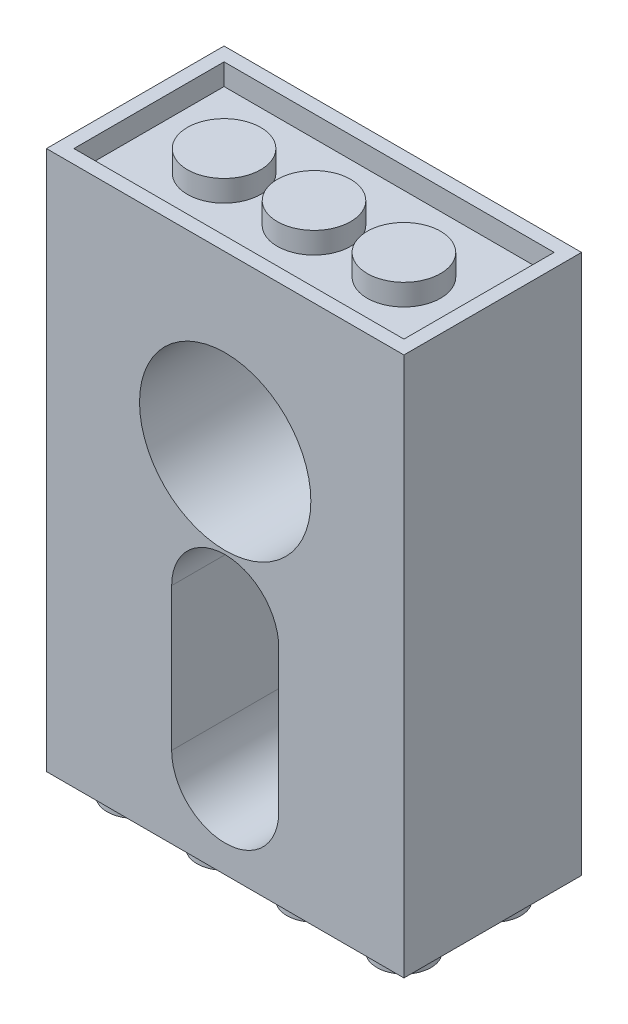
ISO-10303-21;
HEADER;
FILE_DESCRIPTION(('STEP AP214'),'2;1');
FILE_NAME('part.step','',(''),(''),'','','');
FILE_SCHEMA(('AUTOMOTIVE_DESIGN { 1 0 10303 214 1 1 1 1 }'));
ENDSEC;
DATA;
#1=APPLICATION_CONTEXT('core data for automotive mechanical design processes');
#2=APPLICATION_PROTOCOL_DEFINITION('international standard','automotive_design',2000,#1);
#3=PRODUCT_CONTEXT('',#1,'mechanical');
#4=PRODUCT('Part','Part','',(#3));
#5=PRODUCT_RELATED_PRODUCT_CATEGORY('part','',(#4));
#6=PRODUCT_DEFINITION_FORMATION('','',#4);
#7=PRODUCT_DEFINITION_CONTEXT('part definition',#1,'design');
#8=PRODUCT_DEFINITION('design','',#6,#7);
#9=PRODUCT_DEFINITION_SHAPE('','',#8);
#10=(LENGTH_UNIT() NAMED_UNIT(*) SI_UNIT(.MILLI.,.METRE.));
#11=(NAMED_UNIT(*) PLANE_ANGLE_UNIT() SI_UNIT($,.RADIAN.));
#12=(NAMED_UNIT(*) SI_UNIT($,.STERADIAN.) SOLID_ANGLE_UNIT());
#13=UNCERTAINTY_MEASURE_WITH_UNIT(LENGTH_MEASURE(1.E-05),#10,'distance_accuracy_value','');
#14=(GEOMETRIC_REPRESENTATION_CONTEXT(3) GLOBAL_UNCERTAINTY_ASSIGNED_CONTEXT((#13)) GLOBAL_UNIT_ASSIGNED_CONTEXT((#10,
#11,#12)) REPRESENTATION_CONTEXT('',''));
#15=CARTESIAN_POINT('',(0.,0.,0.));
#16=DIRECTION('',(0.,0.,1.));
#17=DIRECTION('',(1.,0.,0.));
#18=AXIS2_PLACEMENT_3D('',#15,#16,#17);
#19=CARTESIAN_POINT('',(-15.9,-24.,15.8));
#20=DIRECTION('',(0.,1.,0.));
#21=DIRECTION('',(0.,0.,1.));
#22=AXIS2_PLACEMENT_3D('',#19,#20,#21);
#23=PLANE('',#22);
#24=CARTESIAN_POINT('',(12.,-24.,11.9));
#25=DIRECTION('',(0.,1.,0.));
#26=DIRECTION('',(0.,0.,1.));
#27=AXIS2_PLACEMENT_3D('',#24,#25,#26);
#28=CIRCLE('',#27,2.4);
#29=CARTESIAN_POINT('',(12.,-24.,14.3));
#30=VERTEX_POINT('',#29);
#31=EDGE_CURVE('E41',#30,#30,#28,.F.);
#32=ORIENTED_EDGE('',*,*,#31,.F.);
#33=EDGE_LOOP('',(#32));
#34=FACE_BOUND('',#33,.T.);
#35=CARTESIAN_POINT('',(4.00000000000001,-24.,11.9));
#36=DIRECTION('',(0.,1.,0.));
#37=DIRECTION('',(0.,0.,1.));
#38=AXIS2_PLACEMENT_3D('',#35,#36,#37);
#39=CIRCLE('',#38,2.4);
#40=CARTESIAN_POINT('',(4.00000000000001,-24.,14.3));
#41=VERTEX_POINT('',#40);
#42=EDGE_CURVE('E340',#41,#41,#39,.F.);
#43=ORIENTED_EDGE('',*,*,#42,.F.);
#44=EDGE_LOOP('',(#43));
#45=FACE_BOUND('',#44,.T.);
#46=CARTESIAN_POINT('',(-3.99999999999999,-24.,11.9));
#47=DIRECTION('',(0.,1.,0.));
#48=DIRECTION('',(0.,0.,1.));
#49=AXIS2_PLACEMENT_3D('',#46,#47,#48);
#50=CIRCLE('',#49,2.4);
#51=CARTESIAN_POINT('',(-3.99999999999999,-24.,14.3));
#52=VERTEX_POINT('',#51);
#53=EDGE_CURVE('E334',#52,#52,#50,.F.);
#54=ORIENTED_EDGE('',*,*,#53,.F.);
#55=EDGE_LOOP('',(#54));
#56=FACE_BOUND('',#55,.T.);
#57=CARTESIAN_POINT('',(-12.,-24.,11.9));
#58=DIRECTION('',(0.,1.,0.));
#59=DIRECTION('',(0.,0.,1.));
#60=AXIS2_PLACEMENT_3D('',#57,#58,#59);
#61=CIRCLE('',#60,2.4);
#62=CARTESIAN_POINT('',(-12.,-24.,14.3));
#63=VERTEX_POINT('',#62);
#64=EDGE_CURVE('E320',#63,#63,#61,.F.);
#65=ORIENTED_EDGE('',*,*,#64,.F.);
#66=EDGE_LOOP('',(#65));
#67=FACE_BOUND('',#66,.T.);
#68=DIRECTION('',(1.,0.,0.));
#69=VECTOR('',#68,1.);
#70=CARTESIAN_POINT('',(-15.9,-24.,0.));
#71=LINE('',#70,#69);
#72=CARTESIAN_POINT('',(-15.9,-24.,0.));
#73=VERTEX_POINT('',#72);
#74=CARTESIAN_POINT('',(15.9,-24.,0.));
#75=VERTEX_POINT('',#74);
#76=EDGE_CURVE('E295',#73,#75,#71,.T.);
#77=ORIENTED_EDGE('',*,*,#76,.T.);
#78=DIRECTION('',(0.,0.,-1.));
#79=VECTOR('',#78,1.);
#80=CARTESIAN_POINT('',(15.9,-24.,15.8));
#81=LINE('',#80,#79);
#82=CARTESIAN_POINT('',(15.9,-24.,15.8));
#83=VERTEX_POINT('',#82);
#84=EDGE_CURVE('E301',#83,#75,#81,.T.);
#85=ORIENTED_EDGE('',*,*,#84,.F.);
#86=DIRECTION('',(1.,0.,0.));
#87=VECTOR('',#86,1.);
#88=CARTESIAN_POINT('',(-15.9,-24.,15.8));
#89=LINE('',#88,#87);
#90=CARTESIAN_POINT('',(-15.9,-24.,15.8));
#91=VERTEX_POINT('',#90);
#92=EDGE_CURVE('E299',#91,#83,#89,.T.);
#93=ORIENTED_EDGE('',*,*,#92,.F.);
#94=DIRECTION('',(0.,0.,-1.));
#95=VECTOR('',#94,1.);
#96=CARTESIAN_POINT('',(-15.9,-24.,15.8));
#97=LINE('',#96,#95);
#98=EDGE_CURVE('E311',#91,#73,#97,.T.);
#99=ORIENTED_EDGE('',*,*,#98,.T.);
#100=EDGE_LOOP('',(#77,#85,#93,#99));
#101=FACE_BOUND('',#100,.T.);
#102=CARTESIAN_POINT('',(-12.,-24.,3.9));
#103=DIRECTION('',(0.,1.,0.));
#104=DIRECTION('',(0.,0.,1.));
#105=AXIS2_PLACEMENT_3D('',#102,#103,#104);
#106=CIRCLE('',#105,2.4);
#107=CARTESIAN_POINT('',(-12.,-24.,6.3));
#108=VERTEX_POINT('',#107);
#109=EDGE_CURVE('E331',#108,#108,#106,.F.);
#110=ORIENTED_EDGE('',*,*,#109,.F.);
#111=EDGE_LOOP('',(#110));
#112=FACE_BOUND('',#111,.T.);
#113=CARTESIAN_POINT('',(-3.99999999999999,-24.,3.9));
#114=DIRECTION('',(0.,1.,0.));
#115=DIRECTION('',(0.,0.,1.));
#116=AXIS2_PLACEMENT_3D('',#113,#114,#115);
#117=CIRCLE('',#116,2.4);
#118=CARTESIAN_POINT('',(-3.99999999999999,-24.,6.3));
#119=VERTEX_POINT('',#118);
#120=EDGE_CURVE('E337',#119,#119,#117,.F.);
#121=ORIENTED_EDGE('',*,*,#120,.F.);
#122=EDGE_LOOP('',(#121));
#123=FACE_BOUND('',#122,.T.);
#124=CARTESIAN_POINT('',(4.00000000000001,-24.,3.9));
#125=DIRECTION('',(0.,1.,0.));
#126=DIRECTION('',(0.,0.,1.));
#127=AXIS2_PLACEMENT_3D('',#124,#125,#126);
#128=CIRCLE('',#127,2.4);
#129=CARTESIAN_POINT('',(4.00000000000001,-24.,6.3));
#130=VERTEX_POINT('',#129);
#131=EDGE_CURVE('E343',#130,#130,#128,.F.);
#132=ORIENTED_EDGE('',*,*,#131,.F.);
#133=EDGE_LOOP('',(#132));
#134=FACE_BOUND('',#133,.T.);
#135=CARTESIAN_POINT('',(12.,-24.,3.9));
#136=DIRECTION('',(0.,1.,0.));
#137=DIRECTION('',(0.,0.,1.));
#138=AXIS2_PLACEMENT_3D('',#135,#136,#137);
#139=CIRCLE('',#138,2.4);
#140=CARTESIAN_POINT('',(12.,-24.,6.3));
#141=VERTEX_POINT('',#140);
#142=EDGE_CURVE('E11',#141,#141,#139,.F.);
#143=ORIENTED_EDGE('',*,*,#142,.F.);
#144=EDGE_LOOP('',(#143));
#145=FACE_BOUND('',#144,.T.);
#146=ADVANCED_FACE('F33',(#34,#45,#56,#67,#101,#112,#123,#134,#145),#23,.F.);
#147=CARTESIAN_POINT('',(0.,-4.1,12.7));
#148=DIRECTION('',(0.,0.,-1.));
#149=DIRECTION('',(-1.,0.,0.));
#150=AXIS2_PLACEMENT_3D('',#147,#148,#149);
#151=CYLINDRICAL_SURFACE('',#150,1.8415);
#152=CARTESIAN_POINT('',(0.,-4.1,3.1));
#153=DIRECTION('',(0.,0.,1.));
#154=DIRECTION('',(1.,0.,0.));
#155=AXIS2_PLACEMENT_3D('',#152,#153,#154);
#156=CIRCLE('',#155,1.8415);
#157=CARTESIAN_POINT('',(1.8415,-4.1,3.1));
#158=VERTEX_POINT('',#157);
#159=EDGE_CURVE('E251',#158,#158,#156,.T.);
#160=ORIENTED_EDGE('',*,*,#159,.T.);
#161=EDGE_LOOP('',(#160));
#162=FACE_BOUND('',#161,.T.);
#163=CARTESIAN_POINT('',(0.,-4.1,1.905));
#164=DIRECTION('',(0.,0.,-1.));
#165=DIRECTION('',(-1.,0.,0.));
#166=AXIS2_PLACEMENT_3D('',#163,#164,#165);
#167=CIRCLE('',#166,1.8415);
#168=CARTESIAN_POINT('',(-1.8415,-4.1,1.905));
#169=VERTEX_POINT('',#168);
#170=EDGE_CURVE('E243',#169,#169,#167,.F.);
#171=ORIENTED_EDGE('',*,*,#170,.F.);
#172=EDGE_LOOP('',(#171));
#173=FACE_BOUND('',#172,.T.);
#174=ADVANCED_FACE('F352',(#162,#173),#151,.F.);
#175=CARTESIAN_POINT('',(0.,-16.8,12.7));
#176=DIRECTION('',(0.,0.,-1.));
#177=DIRECTION('',(-1.,0.,0.));
#178=AXIS2_PLACEMENT_3D('',#175,#176,#177);
#179=CYLINDRICAL_SURFACE('',#178,1.8415);
#180=CARTESIAN_POINT('',(0.,-16.8,3.1));
#181=DIRECTION('',(0.,0.,1.));
#182=DIRECTION('',(1.,0.,0.));
#183=AXIS2_PLACEMENT_3D('',#180,#181,#182);
#184=CIRCLE('',#183,1.8415);
#185=CARTESIAN_POINT('',(1.8415,-16.8,3.1));
#186=VERTEX_POINT('',#185);
#187=EDGE_CURVE('E246',#186,#186,#184,.T.);
#188=ORIENTED_EDGE('',*,*,#187,.T.);
#189=EDGE_LOOP('',(#188));
#190=FACE_BOUND('',#189,.T.);
#191=CARTESIAN_POINT('',(0.,-16.8,1.905));
#192=DIRECTION('',(0.,0.,-1.));
#193=DIRECTION('',(-1.,0.,0.));
#194=AXIS2_PLACEMENT_3D('',#191,#192,#193);
#195=CIRCLE('',#194,1.8415);
#196=CARTESIAN_POINT('',(-1.8415,-16.8,1.905));
#197=VERTEX_POINT('',#196);
#198=EDGE_CURVE('E237',#197,#197,#195,.F.);
#199=ORIENTED_EDGE('',*,*,#198,.F.);
#200=EDGE_LOOP('',(#199));
#201=FACE_BOUND('',#200,.T.);
#202=ADVANCED_FACE('F459',(#190,#201),#179,.F.);
#203=CARTESIAN_POINT('',(15.9,24.,15.8));
#204=DIRECTION('',(-1.,0.,0.));
#205=DIRECTION('',(0.,-1.,0.));
#206=AXIS2_PLACEMENT_3D('',#203,#204,#205);
#207=PLANE('',#206);
#208=DIRECTION('',(0.,1.,0.));
#209=VECTOR('',#208,1.);
#210=CARTESIAN_POINT('',(15.9,24.,0.));
#211=LINE('',#210,#209);
#212=CARTESIAN_POINT('',(15.9,24.,0.));
#213=VERTEX_POINT('',#212);
#214=EDGE_CURVE('E288',#75,#213,#211,.T.);
#215=ORIENTED_EDGE('',*,*,#214,.T.);
#216=DIRECTION('',(0.,0.,-1.));
#217=VECTOR('',#216,1.);
#218=CARTESIAN_POINT('',(15.9,24.,15.8));
#219=LINE('',#218,#217);
#220=CARTESIAN_POINT('',(15.9,24.,15.8));
#221=VERTEX_POINT('',#220);
#222=EDGE_CURVE('E317',#221,#213,#219,.T.);
#223=ORIENTED_EDGE('',*,*,#222,.F.);
#224=DIRECTION('',(0.,1.,0.));
#225=VECTOR('',#224,1.);
#226=CARTESIAN_POINT('',(15.9,24.,15.8));
#227=LINE('',#226,#225);
#228=EDGE_CURVE('E291',#83,#221,#227,.T.);
#229=ORIENTED_EDGE('',*,*,#228,.F.);
#230=ORIENTED_EDGE('',*,*,#84,.T.);
#231=EDGE_LOOP('',(#215,#223,#229,#230));
#232=FACE_BOUND('',#231,.T.);
#233=ADVANCED_FACE('F35',(#232),#207,.F.);
#234=CARTESIAN_POINT('',(-15.9,24.,15.8));
#235=DIRECTION('',(0.,-1.,0.));
#236=DIRECTION('',(0.,0.,-1.));
#237=AXIS2_PLACEMENT_3D('',#234,#235,#236);
#238=PLANE('',#237);
#239=DIRECTION('',(1.,0.,0.));
#240=VECTOR('',#239,1.);
#241=CARTESIAN_POINT('',(-14.68,24.,14.58));
#242=LINE('',#241,#240);
#243=CARTESIAN_POINT('',(-14.68,24.,14.58));
#244=VERTEX_POINT('',#243);
#245=CARTESIAN_POINT('',(14.68,24.,14.58));
#246=VERTEX_POINT('',#245);
#247=EDGE_CURVE('E178',#244,#246,#242,.T.);
#248=ORIENTED_EDGE('',*,*,#247,.F.);
#249=DIRECTION('',(0.,0.,1.));
#250=VECTOR('',#249,1.);
#251=CARTESIAN_POINT('',(-14.68,24.,14.58));
#252=LINE('',#251,#250);
#253=CARTESIAN_POINT('',(-14.68,24.,1.22));
#254=VERTEX_POINT('',#253);
#255=EDGE_CURVE('E48',#254,#244,#252,.T.);
#256=ORIENTED_EDGE('',*,*,#255,.F.);
#257=DIRECTION('',(-1.,0.,0.));
#258=VECTOR('',#257,1.);
#259=CARTESIAN_POINT('',(-14.68,24.,1.22));
#260=LINE('',#259,#258);
#261=CARTESIAN_POINT('',(14.68,24.,1.22));
#262=VERTEX_POINT('',#261);
#263=EDGE_CURVE('E166',#262,#254,#260,.T.);
#264=ORIENTED_EDGE('',*,*,#263,.F.);
#265=DIRECTION('',(0.,0.,-1.));
#266=VECTOR('',#265,1.);
#267=CARTESIAN_POINT('',(14.68,24.,14.58));
#268=LINE('',#267,#266);
#269=EDGE_CURVE('E169',#246,#262,#268,.T.);
#270=ORIENTED_EDGE('',*,*,#269,.F.);
#271=EDGE_LOOP('',(#248,#256,#264,#270));
#272=FACE_BOUND('',#271,.T.);
#273=DIRECTION('',(-1.,0.,0.));
#274=VECTOR('',#273,1.);
#275=CARTESIAN_POINT('',(-15.9,24.,0.));
#276=LINE('',#275,#274);
#277=CARTESIAN_POINT('',(-15.9,24.,0.));
#278=VERTEX_POINT('',#277);
#279=EDGE_CURVE('E304',#213,#278,#276,.T.);
#280=ORIENTED_EDGE('',*,*,#279,.T.);
#281=DIRECTION('',(0.,0.,-1.));
#282=VECTOR('',#281,1.);
#283=CARTESIAN_POINT('',(-15.9,24.,15.8));
#284=LINE('',#283,#282);
#285=CARTESIAN_POINT('',(-15.9,24.,15.8));
#286=VERTEX_POINT('',#285);
#287=EDGE_CURVE('E314',#286,#278,#284,.T.);
#288=ORIENTED_EDGE('',*,*,#287,.F.);
#289=DIRECTION('',(-1.,0.,0.));
#290=VECTOR('',#289,1.);
#291=CARTESIAN_POINT('',(-15.9,24.,15.8));
#292=LINE('',#291,#290);
#293=EDGE_CURVE('E294',#221,#286,#292,.T.);
#294=ORIENTED_EDGE('',*,*,#293,.F.);
#295=ORIENTED_EDGE('',*,*,#222,.T.);
#296=EDGE_LOOP('',(#280,#288,#294,#295));
#297=FACE_BOUND('',#296,.T.);
#298=ADVANCED_FACE('F507',(#272,#297),#238,.F.);
#299=CARTESIAN_POINT('',(-15.9,24.,15.8));
#300=DIRECTION('',(1.,0.,0.));
#301=DIRECTION('',(0.,1.,0.));
#302=AXIS2_PLACEMENT_3D('',#299,#300,#301);
#303=PLANE('',#302);
#304=DIRECTION('',(0.,-1.,0.));
#305=VECTOR('',#304,1.);
#306=CARTESIAN_POINT('',(-15.9,24.,0.));
#307=LINE('',#306,#305);
#308=EDGE_CURVE('E306',#278,#73,#307,.T.);
#309=ORIENTED_EDGE('',*,*,#308,.T.);
#310=ORIENTED_EDGE('',*,*,#98,.F.);
#311=DIRECTION('',(0.,-1.,0.));
#312=VECTOR('',#311,1.);
#313=CARTESIAN_POINT('',(-15.9,24.,15.8));
#314=LINE('',#313,#312);
#315=EDGE_CURVE('E297',#286,#91,#314,.T.);
#316=ORIENTED_EDGE('',*,*,#315,.F.);
#317=ORIENTED_EDGE('',*,*,#287,.T.);
#318=EDGE_LOOP('',(#309,#310,#316,#317));
#319=FACE_BOUND('',#318,.T.);
#320=ADVANCED_FACE('F501',(#319),#303,.F.);
#321=CARTESIAN_POINT('',(15.9,-24.,15.8));
#322=DIRECTION('',(0.,0.,1.));
#323=DIRECTION('',(1.,0.,0.));
#324=AXIS2_PLACEMENT_3D('',#321,#322,#323);
#325=PLANE('',#324);
#326=CARTESIAN_POINT('',(0.,-4.1,15.8));
#327=DIRECTION('',(0.,0.,1.));
#328=DIRECTION('',(1.,0.,0.));
#329=AXIS2_PLACEMENT_3D('',#326,#327,#328);
#330=CIRCLE('',#329,4.7625);
#331=CARTESIAN_POINT('',(4.76250000000001,-4.1,15.8));
#332=VERTEX_POINT('',#331);
#333=CARTESIAN_POINT('',(-4.76249999999999,-4.1,15.8));
#334=VERTEX_POINT('',#333);
#335=EDGE_CURVE('E266',#332,#334,#330,.T.);
#336=ORIENTED_EDGE('',*,*,#335,.F.);
#337=DIRECTION('',(0.,1.,0.));
#338=VECTOR('',#337,1.);
#339=CARTESIAN_POINT('',(4.76250000000001,-4.1,15.8));
#340=LINE('',#339,#338);
#341=CARTESIAN_POINT('',(4.76250000000001,-16.8,15.8));
#342=VERTEX_POINT('',#341);
#343=EDGE_CURVE('E256',#342,#332,#340,.T.);
#344=ORIENTED_EDGE('',*,*,#343,.F.);
#345=CARTESIAN_POINT('',(0.,-16.8,15.8));
#346=DIRECTION('',(0.,0.,1.));
#347=DIRECTION('',(1.,0.,0.));
#348=AXIS2_PLACEMENT_3D('',#345,#346,#347);
#349=CIRCLE('',#348,4.7625);
#350=CARTESIAN_POINT('',(-4.76249999999999,-16.8,15.8));
#351=VERTEX_POINT('',#350);
#352=EDGE_CURVE('E271',#351,#342,#349,.T.);
#353=ORIENTED_EDGE('',*,*,#352,.F.);
#354=DIRECTION('',(0.,-1.,0.));
#355=VECTOR('',#354,1.);
#356=CARTESIAN_POINT('',(-4.76249999999999,-4.1,15.8));
#357=LINE('',#356,#355);
#358=EDGE_CURVE('E268',#334,#351,#357,.T.);
#359=ORIENTED_EDGE('',*,*,#358,.F.);
#360=EDGE_LOOP('',(#336,#344,#353,#359));
#361=FACE_BOUND('',#360,.T.);
#362=CARTESIAN_POINT('',(0.,8.6,15.8));
#363=DIRECTION('',(0.,0.,1.));
#364=DIRECTION('',(1.,0.,0.));
#365=AXIS2_PLACEMENT_3D('',#362,#363,#364);
#366=CIRCLE('',#365,7.62);
#367=CARTESIAN_POINT('',(7.62000000000001,8.6,15.8));
#368=VERTEX_POINT('',#367);
#369=EDGE_CURVE('E278',#368,#368,#366,.T.);
#370=ORIENTED_EDGE('',*,*,#369,.F.);
#371=EDGE_LOOP('',(#370));
#372=FACE_BOUND('',#371,.T.);
#373=ORIENTED_EDGE('',*,*,#228,.T.);
#374=ORIENTED_EDGE('',*,*,#293,.T.);
#375=ORIENTED_EDGE('',*,*,#315,.T.);
#376=ORIENTED_EDGE('',*,*,#92,.T.);
#377=EDGE_LOOP('',(#373,#374,#375,#376));
#378=FACE_BOUND('',#377,.T.);
#379=ADVANCED_FACE('F498',(#361,#372,#378),#325,.T.);
#380=CARTESIAN_POINT('',(15.9,-24.,0.));
#381=DIRECTION('',(0.,0.,1.));
#382=DIRECTION('',(1.,0.,0.));
#383=AXIS2_PLACEMENT_3D('',#380,#381,#382);
#384=PLANE('',#383);
#385=DIRECTION('',(0.,-1.,0.));
#386=VECTOR('',#385,1.);
#387=CARTESIAN_POINT('',(4.76250000000001,-4.1,0.));
#388=LINE('',#387,#386);
#389=CARTESIAN_POINT('',(4.76250000000001,-4.1,0.));
#390=VERTEX_POINT('',#389);
#391=CARTESIAN_POINT('',(4.76250000000001,-16.8,0.));
#392=VERTEX_POINT('',#391);
#393=EDGE_CURVE('E227',#390,#392,#388,.T.);
#394=ORIENTED_EDGE('',*,*,#393,.F.);
#395=CARTESIAN_POINT('',(0.,-4.1,0.));
#396=DIRECTION('',(0.,0.,-1.));
#397=DIRECTION('',(-1.,0.,0.));
#398=AXIS2_PLACEMENT_3D('',#395,#396,#397);
#399=CIRCLE('',#398,4.7625);
#400=CARTESIAN_POINT('',(-4.76249999999999,-4.1,0.));
#401=VERTEX_POINT('',#400);
#402=EDGE_CURVE('E56',#401,#390,#399,.T.);
#403=ORIENTED_EDGE('',*,*,#402,.F.);
#404=DIRECTION('',(0.,1.,0.));
#405=VECTOR('',#404,1.);
#406=CARTESIAN_POINT('',(-4.76249999999999,-16.8,0.));
#407=LINE('',#406,#405);
#408=CARTESIAN_POINT('',(-4.76249999999999,-16.8,0.));
#409=VERTEX_POINT('',#408);
#410=EDGE_CURVE('E216',#409,#401,#407,.T.);
#411=ORIENTED_EDGE('',*,*,#410,.F.);
#412=CARTESIAN_POINT('',(0.,-16.8,0.));
#413=DIRECTION('',(0.,0.,-1.));
#414=DIRECTION('',(-1.,0.,0.));
#415=AXIS2_PLACEMENT_3D('',#412,#413,#414);
#416=CIRCLE('',#415,4.7625);
#417=EDGE_CURVE('E230',#392,#409,#416,.T.);
#418=ORIENTED_EDGE('',*,*,#417,.F.);
#419=EDGE_LOOP('',(#394,#403,#411,#418));
#420=FACE_BOUND('',#419,.T.);
#421=CARTESIAN_POINT('',(0.,8.6,0.));
#422=DIRECTION('',(0.,0.,-1.));
#423=DIRECTION('',(-1.,0.,0.));
#424=AXIS2_PLACEMENT_3D('',#421,#422,#423);
#425=CIRCLE('',#424,2.77815);
#426=CARTESIAN_POINT('',(-2.77815,8.6,0.));
#427=VERTEX_POINT('',#426);
#428=EDGE_CURVE('E247',#427,#427,#425,.T.);
#429=ORIENTED_EDGE('',*,*,#428,.F.);
#430=EDGE_LOOP('',(#429));
#431=FACE_BOUND('',#430,.T.);
#432=ORIENTED_EDGE('',*,*,#214,.F.);
#433=ORIENTED_EDGE('',*,*,#76,.F.);
#434=ORIENTED_EDGE('',*,*,#308,.F.);
#435=ORIENTED_EDGE('',*,*,#279,.F.);
#436=EDGE_LOOP('',(#432,#433,#434,#435));
#437=FACE_BOUND('',#436,.T.);
#438=ADVANCED_FACE('F496',(#420,#431,#437),#384,.F.);
#439=CARTESIAN_POINT('',(0.,8.6,3.1));
#440=DIRECTION('',(0.,0.,1.));
#441=DIRECTION('',(1.,0.,0.));
#442=AXIS2_PLACEMENT_3D('',#439,#440,#441);
#443=CYLINDRICAL_SURFACE('',#442,7.62);
#444=CARTESIAN_POINT('',(0.,8.6,3.1));
#445=DIRECTION('',(0.,0.,1.));
#446=DIRECTION('',(1.,0.,0.));
#447=AXIS2_PLACEMENT_3D('',#444,#445,#446);
#448=CIRCLE('',#447,7.62);
#449=CARTESIAN_POINT('',(7.62000000000001,8.6,3.1));
#450=VERTEX_POINT('',#449);
#451=EDGE_CURVE('E285',#450,#450,#448,.T.);
#452=ORIENTED_EDGE('',*,*,#451,.F.);
#453=EDGE_LOOP('',(#452));
#454=FACE_BOUND('',#453,.T.);
#455=ORIENTED_EDGE('',*,*,#369,.T.);
#456=EDGE_LOOP('',(#455));
#457=FACE_BOUND('',#456,.T.);
#458=ADVANCED_FACE('F492',(#454,#457),#443,.F.);
#459=CARTESIAN_POINT('',(0.,8.6,3.1));
#460=DIRECTION('',(0.,0.,1.));
#461=DIRECTION('',(1.,0.,0.));
#462=AXIS2_PLACEMENT_3D('',#459,#460,#461);
#463=PLANE('',#462);
#464=CARTESIAN_POINT('',(0.,8.6,3.1));
#465=DIRECTION('',(0.,0.,1.));
#466=DIRECTION('',(1.,0.,0.));
#467=AXIS2_PLACEMENT_3D('',#464,#465,#466);
#468=CIRCLE('',#467,2.77815);
#469=CARTESIAN_POINT('',(2.77815,8.6,3.1));
#470=VERTEX_POINT('',#469);
#471=EDGE_CURVE('E250',#470,#470,#468,.T.);
#472=ORIENTED_EDGE('',*,*,#471,.F.);
#473=EDGE_LOOP('',(#472));
#474=FACE_BOUND('',#473,.T.);
#475=ORIENTED_EDGE('',*,*,#451,.T.);
#476=EDGE_LOOP('',(#475));
#477=FACE_BOUND('',#476,.T.);
#478=ADVANCED_FACE('F488',(#474,#477),#463,.T.);
#479=CARTESIAN_POINT('',(0.,-4.1,3.1));
#480=DIRECTION('',(0.,0.,1.));
#481=DIRECTION('',(1.,0.,0.));
#482=AXIS2_PLACEMENT_3D('',#479,#480,#481);
#483=CYLINDRICAL_SURFACE('',#482,4.7625);
#484=ORIENTED_EDGE('',*,*,#335,.T.);
#485=DIRECTION('',(0.,0.,1.));
#486=VECTOR('',#485,1.);
#487=CARTESIAN_POINT('',(-4.76249999999999,-4.1,3.1));
#488=LINE('',#487,#486);
#489=CARTESIAN_POINT('',(-4.76249999999999,-4.1,3.1));
#490=VERTEX_POINT('',#489);
#491=EDGE_CURVE('E265',#490,#334,#488,.T.);
#492=ORIENTED_EDGE('',*,*,#491,.F.);
#493=CARTESIAN_POINT('',(0.,-4.1,3.1));
#494=DIRECTION('',(0.,0.,1.));
#495=DIRECTION('',(1.,0.,0.));
#496=AXIS2_PLACEMENT_3D('',#493,#494,#495);
#497=CIRCLE('',#496,4.7625);
#498=CARTESIAN_POINT('',(4.76250000000001,-4.1,3.1));
#499=VERTEX_POINT('',#498);
#500=EDGE_CURVE('E252',#499,#490,#497,.T.);
#501=ORIENTED_EDGE('',*,*,#500,.F.);
#502=DIRECTION('',(0.,0.,1.));
#503=VECTOR('',#502,1.);
#504=CARTESIAN_POINT('',(4.76250000000001,-4.1,3.1));
#505=LINE('',#504,#503);
#506=EDGE_CURVE('E276',#499,#332,#505,.T.);
#507=ORIENTED_EDGE('',*,*,#506,.T.);
#508=EDGE_LOOP('',(#484,#492,#501,#507));
#509=FACE_BOUND('',#508,.T.);
#510=ADVANCED_FACE('F478',(#509),#483,.F.);
#511=CARTESIAN_POINT('',(4.76250000000001,-4.1,3.1));
#512=DIRECTION('',(1.,0.,0.));
#513=DIRECTION('',(0.,1.,0.));
#514=AXIS2_PLACEMENT_3D('',#511,#512,#513);
#515=PLANE('',#514);
#516=ORIENTED_EDGE('',*,*,#343,.T.);
#517=ORIENTED_EDGE('',*,*,#506,.F.);
#518=DIRECTION('',(0.,1.,0.));
#519=VECTOR('',#518,1.);
#520=CARTESIAN_POINT('',(4.76250000000001,-4.1,3.1));
#521=LINE('',#520,#519);
#522=CARTESIAN_POINT('',(4.76250000000001,-16.8,3.1));
#523=VERTEX_POINT('',#522);
#524=EDGE_CURVE('E262',#523,#499,#521,.T.);
#525=ORIENTED_EDGE('',*,*,#524,.F.);
#526=DIRECTION('',(0.,0.,1.));
#527=VECTOR('',#526,1.);
#528=CARTESIAN_POINT('',(4.76250000000001,-16.8,3.1));
#529=LINE('',#528,#527);
#530=EDGE_CURVE('E279',#523,#342,#529,.T.);
#531=ORIENTED_EDGE('',*,*,#530,.T.);
#532=EDGE_LOOP('',(#516,#517,#525,#531));
#533=FACE_BOUND('',#532,.T.);
#534=ADVANCED_FACE('F474',(#533),#515,.F.);
#535=CARTESIAN_POINT('',(0.,-16.8,3.1));
#536=DIRECTION('',(0.,0.,1.));
#537=DIRECTION('',(1.,0.,0.));
#538=AXIS2_PLACEMENT_3D('',#535,#536,#537);
#539=CYLINDRICAL_SURFACE('',#538,4.7625);
#540=ORIENTED_EDGE('',*,*,#352,.T.);
#541=ORIENTED_EDGE('',*,*,#530,.F.);
#542=CARTESIAN_POINT('',(0.,-16.8,3.1));
#543=DIRECTION('',(0.,0.,1.));
#544=DIRECTION('',(1.,0.,0.));
#545=AXIS2_PLACEMENT_3D('',#542,#543,#544);
#546=CIRCLE('',#545,4.7625);
#547=CARTESIAN_POINT('',(-4.76249999999999,-16.8,3.1));
#548=VERTEX_POINT('',#547);
#549=EDGE_CURVE('E259',#548,#523,#546,.T.);
#550=ORIENTED_EDGE('',*,*,#549,.F.);
#551=DIRECTION('',(0.,0.,1.));
#552=VECTOR('',#551,1.);
#553=CARTESIAN_POINT('',(-4.76249999999999,-16.8,3.1));
#554=LINE('',#553,#552);
#555=EDGE_CURVE('E281',#548,#351,#554,.T.);
#556=ORIENTED_EDGE('',*,*,#555,.T.);
#557=EDGE_LOOP('',(#540,#541,#550,#556));
#558=FACE_BOUND('',#557,.T.);
#559=ADVANCED_FACE('F477',(#558),#539,.F.);
#560=CARTESIAN_POINT('',(-4.76249999999999,-4.1,3.1));
#561=DIRECTION('',(-1.,0.,0.));
#562=DIRECTION('',(0.,-1.,0.));
#563=AXIS2_PLACEMENT_3D('',#560,#561,#562);
#564=PLANE('',#563);
#565=ORIENTED_EDGE('',*,*,#358,.T.);
#566=ORIENTED_EDGE('',*,*,#555,.F.);
#567=DIRECTION('',(0.,-1.,0.));
#568=VECTOR('',#567,1.);
#569=CARTESIAN_POINT('',(-4.76249999999999,-4.1,3.1));
#570=LINE('',#569,#568);
#571=EDGE_CURVE('E255',#490,#548,#570,.T.);
#572=ORIENTED_EDGE('',*,*,#571,.F.);
#573=ORIENTED_EDGE('',*,*,#491,.T.);
#574=EDGE_LOOP('',(#565,#566,#572,#573));
#575=FACE_BOUND('',#574,.T.);
#576=ADVANCED_FACE('F472',(#575),#564,.F.);
#577=CARTESIAN_POINT('',(0.,-4.1,3.1));
#578=DIRECTION('',(0.,0.,1.));
#579=DIRECTION('',(1.,0.,0.));
#580=AXIS2_PLACEMENT_3D('',#577,#578,#579);
#581=PLANE('',#580);
#582=ORIENTED_EDGE('',*,*,#187,.F.);
#583=EDGE_LOOP('',(#582));
#584=FACE_BOUND('',#583,.T.);
#585=ORIENTED_EDGE('',*,*,#159,.F.);
#586=EDGE_LOOP('',(#585));
#587=FACE_BOUND('',#586,.T.);
#588=ORIENTED_EDGE('',*,*,#500,.T.);
#589=ORIENTED_EDGE('',*,*,#571,.T.);
#590=ORIENTED_EDGE('',*,*,#549,.T.);
#591=ORIENTED_EDGE('',*,*,#524,.T.);
#592=EDGE_LOOP('',(#588,#589,#590,#591));
#593=FACE_BOUND('',#592,.T.);
#594=ADVANCED_FACE('F468',(#584,#587,#593),#581,.T.);
#595=CARTESIAN_POINT('',(0.,8.6,12.7));
#596=DIRECTION('',(0.,0.,-1.));
#597=DIRECTION('',(-1.,0.,0.));
#598=AXIS2_PLACEMENT_3D('',#595,#596,#597);
#599=CYLINDRICAL_SURFACE('',#598,2.77815);
#600=ORIENTED_EDGE('',*,*,#471,.T.);
#601=EDGE_LOOP('',(#600));
#602=FACE_BOUND('',#601,.T.);
#603=ORIENTED_EDGE('',*,*,#428,.T.);
#604=EDGE_LOOP('',(#603));
#605=FACE_BOUND('',#604,.T.);
#606=ADVANCED_FACE('F444',(#602,#605),#599,.F.);
#607=CARTESIAN_POINT('',(0.,-4.1,1.905));
#608=DIRECTION('',(0.,0.,-1.));
#609=DIRECTION('',(-1.,0.,0.));
#610=AXIS2_PLACEMENT_3D('',#607,#608,#609);
#611=PLANE('',#610);
#612=ORIENTED_EDGE('',*,*,#198,.T.);
#613=EDGE_LOOP('',(#612));
#614=FACE_BOUND('',#613,.T.);
#615=CARTESIAN_POINT('',(0.,-4.1,1.905));
#616=DIRECTION('',(0.,0.,-1.));
#617=DIRECTION('',(-1.,0.,0.));
#618=AXIS2_PLACEMENT_3D('',#615,#616,#617);
#619=CIRCLE('',#618,4.7625);
#620=CARTESIAN_POINT('',(-4.76249999999999,-4.1,1.905));
#621=VERTEX_POINT('',#620);
#622=CARTESIAN_POINT('',(4.76250000000001,-4.1,1.905));
#623=VERTEX_POINT('',#622);
#624=EDGE_CURVE('E212',#621,#623,#619,.T.);
#625=ORIENTED_EDGE('',*,*,#624,.T.);
#626=DIRECTION('',(0.,-1.,0.));
#627=VECTOR('',#626,1.);
#628=CARTESIAN_POINT('',(4.76250000000001,-4.1,1.905));
#629=LINE('',#628,#627);
#630=CARTESIAN_POINT('',(4.76250000000001,-16.8,1.905));
#631=VERTEX_POINT('',#630);
#632=EDGE_CURVE('E215',#623,#631,#629,.T.);
#633=ORIENTED_EDGE('',*,*,#632,.T.);
#634=CARTESIAN_POINT('',(0.,-16.8,1.905));
#635=DIRECTION('',(0.,0.,-1.));
#636=DIRECTION('',(-1.,0.,0.));
#637=AXIS2_PLACEMENT_3D('',#634,#635,#636);
#638=CIRCLE('',#637,4.7625);
#639=CARTESIAN_POINT('',(-4.76249999999999,-16.8,1.905));
#640=VERTEX_POINT('',#639);
#641=EDGE_CURVE('E219',#631,#640,#638,.T.);
#642=ORIENTED_EDGE('',*,*,#641,.T.);
#643=DIRECTION('',(0.,1.,0.));
#644=VECTOR('',#643,1.);
#645=CARTESIAN_POINT('',(-4.76249999999999,-16.8,1.905));
#646=LINE('',#645,#644);
#647=EDGE_CURVE('E222',#640,#621,#646,.T.);
#648=ORIENTED_EDGE('',*,*,#647,.T.);
#649=EDGE_LOOP('',(#625,#633,#642,#648));
#650=FACE_BOUND('',#649,.T.);
#651=ORIENTED_EDGE('',*,*,#170,.T.);
#652=EDGE_LOOP('',(#651));
#653=FACE_BOUND('',#652,.T.);
#654=ADVANCED_FACE('F440',(#614,#650,#653),#611,.T.);
#655=CARTESIAN_POINT('',(0.,-4.1,1.905));
#656=DIRECTION('',(0.,0.,-1.));
#657=DIRECTION('',(-1.,0.,0.));
#658=AXIS2_PLACEMENT_3D('',#655,#656,#657);
#659=CYLINDRICAL_SURFACE('',#658,4.7625);
#660=ORIENTED_EDGE('',*,*,#402,.T.);
#661=DIRECTION('',(0.,0.,-1.));
#662=VECTOR('',#661,1.);
#663=CARTESIAN_POINT('',(4.76250000000001,-4.1,1.905));
#664=LINE('',#663,#662);
#665=EDGE_CURVE('E225',#623,#390,#664,.T.);
#666=ORIENTED_EDGE('',*,*,#665,.F.);
#667=ORIENTED_EDGE('',*,*,#624,.F.);
#668=DIRECTION('',(0.,0.,-1.));
#669=VECTOR('',#668,1.);
#670=CARTESIAN_POINT('',(-4.76249999999999,-4.1,1.905));
#671=LINE('',#670,#669);
#672=EDGE_CURVE('E235',#621,#401,#671,.T.);
#673=ORIENTED_EDGE('',*,*,#672,.T.);
#674=EDGE_LOOP('',(#660,#666,#667,#673));
#675=FACE_BOUND('',#674,.T.);
#676=ADVANCED_FACE('F443',(#675),#659,.F.);
#677=CARTESIAN_POINT('',(-4.76249999999999,-16.8,1.905));
#678=DIRECTION('',(-1.,0.,0.));
#679=DIRECTION('',(0.,-1.,0.));
#680=AXIS2_PLACEMENT_3D('',#677,#678,#679);
#681=PLANE('',#680);
#682=ORIENTED_EDGE('',*,*,#410,.T.);
#683=ORIENTED_EDGE('',*,*,#672,.F.);
#684=ORIENTED_EDGE('',*,*,#647,.F.);
#685=DIRECTION('',(0.,0.,-1.));
#686=VECTOR('',#685,1.);
#687=CARTESIAN_POINT('',(-4.76249999999999,-16.8,1.905));
#688=LINE('',#687,#686);
#689=EDGE_CURVE('E238',#640,#409,#688,.T.);
#690=ORIENTED_EDGE('',*,*,#689,.T.);
#691=EDGE_LOOP('',(#682,#683,#684,#690));
#692=FACE_BOUND('',#691,.T.);
#693=ADVANCED_FACE('F446',(#692),#681,.F.);
#694=CARTESIAN_POINT('',(0.,-16.8,1.905));
#695=DIRECTION('',(0.,0.,-1.));
#696=DIRECTION('',(-1.,0.,0.));
#697=AXIS2_PLACEMENT_3D('',#694,#695,#696);
#698=CYLINDRICAL_SURFACE('',#697,4.7625);
#699=ORIENTED_EDGE('',*,*,#417,.T.);
#700=ORIENTED_EDGE('',*,*,#689,.F.);
#701=ORIENTED_EDGE('',*,*,#641,.F.);
#702=DIRECTION('',(0.,0.,-1.));
#703=VECTOR('',#702,1.);
#704=CARTESIAN_POINT('',(4.76250000000001,-16.8,1.905));
#705=LINE('',#704,#703);
#706=EDGE_CURVE('E240',#631,#392,#705,.T.);
#707=ORIENTED_EDGE('',*,*,#706,.T.);
#708=EDGE_LOOP('',(#699,#700,#701,#707));
#709=FACE_BOUND('',#708,.T.);
#710=ADVANCED_FACE('F449',(#709),#698,.F.);
#711=CARTESIAN_POINT('',(4.76250000000001,-4.1,1.905));
#712=DIRECTION('',(1.,0.,0.));
#713=DIRECTION('',(0.,1.,0.));
#714=AXIS2_PLACEMENT_3D('',#711,#712,#713);
#715=PLANE('',#714);
#716=ORIENTED_EDGE('',*,*,#393,.T.);
#717=ORIENTED_EDGE('',*,*,#706,.F.);
#718=ORIENTED_EDGE('',*,*,#632,.F.);
#719=ORIENTED_EDGE('',*,*,#665,.T.);
#720=EDGE_LOOP('',(#716,#717,#718,#719));
#721=FACE_BOUND('',#720,.T.);
#722=ADVANCED_FACE('F438',(#721),#715,.F.);
#723=CARTESIAN_POINT('',(-12.,-25.905,11.9));
#724=DIRECTION('',(0.,1.,0.));
#725=DIRECTION('',(0.,0.,1.));
#726=AXIS2_PLACEMENT_3D('',#723,#724,#725);
#727=CYLINDRICAL_SURFACE('',#726,2.4);
#728=CARTESIAN_POINT('',(-12.,-25.905,11.9));
#729=DIRECTION('',(0.,-1.,0.));
#730=DIRECTION('',(0.,0.,-1.));
#731=AXIS2_PLACEMENT_3D('',#728,#729,#730);
#732=CIRCLE('',#731,2.4);
#733=CARTESIAN_POINT('',(-12.,-25.905,9.5));
#734=VERTEX_POINT('',#733);
#735=EDGE_CURVE('E209',#734,#734,#732,.T.);
#736=ORIENTED_EDGE('',*,*,#735,.F.);
#737=EDGE_LOOP('',(#736));
#738=FACE_BOUND('',#737,.T.);
#739=ORIENTED_EDGE('',*,*,#64,.T.);
#740=EDGE_LOOP('',(#739));
#741=FACE_BOUND('',#740,.T.);
#742=ADVANCED_FACE('F434',(#738,#741),#727,.T.);
#743=CARTESIAN_POINT('',(-12.,-25.905,11.9));
#744=DIRECTION('',(0.,-1.,0.));
#745=DIRECTION('',(0.,0.,-1.));
#746=AXIS2_PLACEMENT_3D('',#743,#744,#745);
#747=PLANE('',#746);
#748=ORIENTED_EDGE('',*,*,#735,.T.);
#749=EDGE_LOOP('',(#748));
#750=FACE_BOUND('',#749,.T.);
#751=ADVANCED_FACE('F430',(#750),#747,.T.);
#752=CARTESIAN_POINT('',(-12.,-25.905,3.9));
#753=DIRECTION('',(0.,1.,0.));
#754=DIRECTION('',(0.,0.,1.));
#755=AXIS2_PLACEMENT_3D('',#752,#753,#754);
#756=CYLINDRICAL_SURFACE('',#755,2.4);
#757=CARTESIAN_POINT('',(-12.,-25.905,3.9));
#758=DIRECTION('',(0.,-1.,0.));
#759=DIRECTION('',(0.,0.,-1.));
#760=AXIS2_PLACEMENT_3D('',#757,#758,#759);
#761=CIRCLE('',#760,2.4);
#762=CARTESIAN_POINT('',(-12.,-25.905,1.5));
#763=VERTEX_POINT('',#762);
#764=EDGE_CURVE('E206',#763,#763,#761,.T.);
#765=ORIENTED_EDGE('',*,*,#764,.F.);
#766=EDGE_LOOP('',(#765));
#767=FACE_BOUND('',#766,.T.);
#768=ORIENTED_EDGE('',*,*,#109,.T.);
#769=EDGE_LOOP('',(#768));
#770=FACE_BOUND('',#769,.T.);
#771=ADVANCED_FACE('F426',(#767,#770),#756,.T.);
#772=CARTESIAN_POINT('',(-12.,-25.905,3.9));
#773=DIRECTION('',(0.,-1.,0.));
#774=DIRECTION('',(0.,0.,-1.));
#775=AXIS2_PLACEMENT_3D('',#772,#773,#774);
#776=PLANE('',#775);
#777=ORIENTED_EDGE('',*,*,#764,.T.);
#778=EDGE_LOOP('',(#777));
#779=FACE_BOUND('',#778,.T.);
#780=ADVANCED_FACE('F422',(#779),#776,.T.);
#781=CARTESIAN_POINT('',(-3.99999999999999,-25.905,11.9));
#782=DIRECTION('',(0.,1.,0.));
#783=DIRECTION('',(0.,0.,1.));
#784=AXIS2_PLACEMENT_3D('',#781,#782,#783);
#785=CYLINDRICAL_SURFACE('',#784,2.4);
#786=CARTESIAN_POINT('',(-3.99999999999999,-25.905,11.9));
#787=DIRECTION('',(0.,-1.,0.));
#788=DIRECTION('',(0.,0.,-1.));
#789=AXIS2_PLACEMENT_3D('',#786,#787,#788);
#790=CIRCLE('',#789,2.4);
#791=CARTESIAN_POINT('',(-3.99999999999999,-25.905,9.5));
#792=VERTEX_POINT('',#791);
#793=EDGE_CURVE('E203',#792,#792,#790,.T.);
#794=ORIENTED_EDGE('',*,*,#793,.F.);
#795=EDGE_LOOP('',(#794));
#796=FACE_BOUND('',#795,.T.);
#797=ORIENTED_EDGE('',*,*,#53,.T.);
#798=EDGE_LOOP('',(#797));
#799=FACE_BOUND('',#798,.T.);
#800=ADVANCED_FACE('F418',(#796,#799),#785,.T.);
#801=CARTESIAN_POINT('',(-3.99999999999999,-25.905,11.9));
#802=DIRECTION('',(0.,-1.,0.));
#803=DIRECTION('',(0.,0.,-1.));
#804=AXIS2_PLACEMENT_3D('',#801,#802,#803);
#805=PLANE('',#804);
#806=ORIENTED_EDGE('',*,*,#793,.T.);
#807=EDGE_LOOP('',(#806));
#808=FACE_BOUND('',#807,.T.);
#809=ADVANCED_FACE('F414',(#808),#805,.T.);
#810=CARTESIAN_POINT('',(-3.99999999999999,-25.905,3.9));
#811=DIRECTION('',(0.,1.,0.));
#812=DIRECTION('',(0.,0.,1.));
#813=AXIS2_PLACEMENT_3D('',#810,#811,#812);
#814=CYLINDRICAL_SURFACE('',#813,2.4);
#815=CARTESIAN_POINT('',(-3.99999999999999,-25.905,3.9));
#816=DIRECTION('',(0.,-1.,0.));
#817=DIRECTION('',(0.,0.,-1.));
#818=AXIS2_PLACEMENT_3D('',#815,#816,#817);
#819=CIRCLE('',#818,2.4);
#820=CARTESIAN_POINT('',(-3.99999999999999,-25.905,1.5));
#821=VERTEX_POINT('',#820);
#822=EDGE_CURVE('E200',#821,#821,#819,.T.);
#823=ORIENTED_EDGE('',*,*,#822,.F.);
#824=EDGE_LOOP('',(#823));
#825=FACE_BOUND('',#824,.T.);
#826=ORIENTED_EDGE('',*,*,#120,.T.);
#827=EDGE_LOOP('',(#826));
#828=FACE_BOUND('',#827,.T.);
#829=ADVANCED_FACE('F410',(#825,#828),#814,.T.);
#830=CARTESIAN_POINT('',(-3.99999999999999,-25.905,3.9));
#831=DIRECTION('',(0.,-1.,0.));
#832=DIRECTION('',(0.,0.,-1.));
#833=AXIS2_PLACEMENT_3D('',#830,#831,#832);
#834=PLANE('',#833);
#835=ORIENTED_EDGE('',*,*,#822,.T.);
#836=EDGE_LOOP('',(#835));
#837=FACE_BOUND('',#836,.T.);
#838=ADVANCED_FACE('F406',(#837),#834,.T.);
#839=CARTESIAN_POINT('',(4.00000000000001,-25.905,11.9));
#840=DIRECTION('',(0.,1.,0.));
#841=DIRECTION('',(0.,0.,1.));
#842=AXIS2_PLACEMENT_3D('',#839,#840,#841);
#843=CYLINDRICAL_SURFACE('',#842,2.4);
#844=CARTESIAN_POINT('',(4.00000000000001,-25.905,11.9));
#845=DIRECTION('',(0.,-1.,0.));
#846=DIRECTION('',(0.,0.,-1.));
#847=AXIS2_PLACEMENT_3D('',#844,#845,#846);
#848=CIRCLE('',#847,2.4);
#849=CARTESIAN_POINT('',(4.00000000000001,-25.905,9.5));
#850=VERTEX_POINT('',#849);
#851=EDGE_CURVE('E197',#850,#850,#848,.T.);
#852=ORIENTED_EDGE('',*,*,#851,.F.);
#853=EDGE_LOOP('',(#852));
#854=FACE_BOUND('',#853,.T.);
#855=ORIENTED_EDGE('',*,*,#42,.T.);
#856=EDGE_LOOP('',(#855));
#857=FACE_BOUND('',#856,.T.);
#858=ADVANCED_FACE('F402',(#854,#857),#843,.T.);
#859=CARTESIAN_POINT('',(4.00000000000001,-25.905,11.9));
#860=DIRECTION('',(0.,-1.,0.));
#861=DIRECTION('',(0.,0.,-1.));
#862=AXIS2_PLACEMENT_3D('',#859,#860,#861);
#863=PLANE('',#862);
#864=ORIENTED_EDGE('',*,*,#851,.T.);
#865=EDGE_LOOP('',(#864));
#866=FACE_BOUND('',#865,.T.);
#867=ADVANCED_FACE('F398',(#866),#863,.T.);
#868=CARTESIAN_POINT('',(4.00000000000001,-25.905,3.9));
#869=DIRECTION('',(0.,1.,0.));
#870=DIRECTION('',(0.,0.,1.));
#871=AXIS2_PLACEMENT_3D('',#868,#869,#870);
#872=CYLINDRICAL_SURFACE('',#871,2.4);
#873=CARTESIAN_POINT('',(4.00000000000001,-25.905,3.9));
#874=DIRECTION('',(0.,-1.,0.));
#875=DIRECTION('',(0.,0.,-1.));
#876=AXIS2_PLACEMENT_3D('',#873,#874,#875);
#877=CIRCLE('',#876,2.4);
#878=CARTESIAN_POINT('',(4.00000000000001,-25.905,1.5));
#879=VERTEX_POINT('',#878);
#880=EDGE_CURVE('E194',#879,#879,#877,.T.);
#881=ORIENTED_EDGE('',*,*,#880,.F.);
#882=EDGE_LOOP('',(#881));
#883=FACE_BOUND('',#882,.T.);
#884=ORIENTED_EDGE('',*,*,#131,.T.);
#885=EDGE_LOOP('',(#884));
#886=FACE_BOUND('',#885,.T.);
#887=ADVANCED_FACE('F394',(#883,#886),#872,.T.);
#888=CARTESIAN_POINT('',(4.00000000000001,-25.905,3.9));
#889=DIRECTION('',(0.,-1.,0.));
#890=DIRECTION('',(0.,0.,-1.));
#891=AXIS2_PLACEMENT_3D('',#888,#889,#890);
#892=PLANE('',#891);
#893=ORIENTED_EDGE('',*,*,#880,.T.);
#894=EDGE_LOOP('',(#893));
#895=FACE_BOUND('',#894,.T.);
#896=ADVANCED_FACE('F390',(#895),#892,.T.);
#897=CARTESIAN_POINT('',(12.,-25.905,11.9));
#898=DIRECTION('',(0.,1.,0.));
#899=DIRECTION('',(0.,0.,1.));
#900=AXIS2_PLACEMENT_3D('',#897,#898,#899);
#901=CYLINDRICAL_SURFACE('',#900,2.4);
#902=CARTESIAN_POINT('',(12.,-25.905,11.9));
#903=DIRECTION('',(0.,-1.,0.));
#904=DIRECTION('',(0.,0.,-1.));
#905=AXIS2_PLACEMENT_3D('',#902,#903,#904);
#906=CIRCLE('',#905,2.4);
#907=CARTESIAN_POINT('',(12.,-25.905,9.5));
#908=VERTEX_POINT('',#907);
#909=EDGE_CURVE('E191',#908,#908,#906,.T.);
#910=ORIENTED_EDGE('',*,*,#909,.F.);
#911=EDGE_LOOP('',(#910));
#912=FACE_BOUND('',#911,.T.);
#913=ORIENTED_EDGE('',*,*,#31,.T.);
#914=EDGE_LOOP('',(#913));
#915=FACE_BOUND('',#914,.T.);
#916=ADVANCED_FACE('F348',(#912,#915),#901,.T.);
#917=CARTESIAN_POINT('',(12.,-25.905,11.9));
#918=DIRECTION('',(0.,-1.,0.));
#919=DIRECTION('',(0.,0.,-1.));
#920=AXIS2_PLACEMENT_3D('',#917,#918,#919);
#921=PLANE('',#920);
#922=ORIENTED_EDGE('',*,*,#909,.T.);
#923=EDGE_LOOP('',(#922));
#924=FACE_BOUND('',#923,.T.);
#925=ADVANCED_FACE('F374',(#924),#921,.T.);
#926=CARTESIAN_POINT('',(12.,-25.905,3.9));
#927=DIRECTION('',(0.,1.,0.));
#928=DIRECTION('',(0.,0.,1.));
#929=AXIS2_PLACEMENT_3D('',#926,#927,#928);
#930=CYLINDRICAL_SURFACE('',#929,2.4);
#931=CARTESIAN_POINT('',(12.,-25.905,3.9));
#932=DIRECTION('',(0.,-1.,0.));
#933=DIRECTION('',(0.,0.,-1.));
#934=AXIS2_PLACEMENT_3D('',#931,#932,#933);
#935=CIRCLE('',#934,2.4);
#936=CARTESIAN_POINT('',(12.,-25.905,1.5));
#937=VERTEX_POINT('',#936);
#938=EDGE_CURVE('E185',#937,#937,#935,.T.);
#939=ORIENTED_EDGE('',*,*,#938,.F.);
#940=EDGE_LOOP('',(#939));
#941=FACE_BOUND('',#940,.T.);
#942=ORIENTED_EDGE('',*,*,#142,.T.);
#943=EDGE_LOOP('',(#942));
#944=FACE_BOUND('',#943,.T.);
#945=ADVANCED_FACE('F371',(#941,#944),#930,.T.);
#946=CARTESIAN_POINT('',(12.,-25.905,3.9));
#947=DIRECTION('',(0.,-1.,0.));
#948=DIRECTION('',(0.,0.,-1.));
#949=AXIS2_PLACEMENT_3D('',#946,#947,#948);
#950=PLANE('',#949);
#951=ORIENTED_EDGE('',*,*,#938,.T.);
#952=EDGE_LOOP('',(#951));
#953=FACE_BOUND('',#952,.T.);
#954=ADVANCED_FACE('F373',(#953),#950,.T.);
#955=CARTESIAN_POINT('',(-14.68,22.095,14.58));
#956=DIRECTION('',(-1.,0.,0.));
#957=DIRECTION('',(0.,0.,1.));
#958=AXIS2_PLACEMENT_3D('',#955,#956,#957);
#959=PLANE('',#958);
#960=ORIENTED_EDGE('',*,*,#255,.T.);
#961=DIRECTION('',(0.,1.,0.));
#962=VECTOR('',#961,1.);
#963=CARTESIAN_POINT('',(-14.68,22.095,14.58));
#964=LINE('',#963,#962);
#965=CARTESIAN_POINT('',(-14.68,22.095,14.58));
#966=VERTEX_POINT('',#965);
#967=EDGE_CURVE('E144',#966,#244,#964,.T.);
#968=ORIENTED_EDGE('',*,*,#967,.F.);
#969=DIRECTION('',(0.,0.,1.));
#970=VECTOR('',#969,1.);
#971=CARTESIAN_POINT('',(-14.68,22.095,14.58));
#972=LINE('',#971,#970);
#973=CARTESIAN_POINT('',(-14.68,22.095,1.22));
#974=VERTEX_POINT('',#973);
#975=EDGE_CURVE('E148',#974,#966,#972,.T.);
#976=ORIENTED_EDGE('',*,*,#975,.F.);
#977=DIRECTION('',(0.,1.,0.));
#978=VECTOR('',#977,1.);
#979=CARTESIAN_POINT('',(-14.68,22.095,1.22));
#980=LINE('',#979,#978);
#981=EDGE_CURVE('E183',#974,#254,#980,.T.);
#982=ORIENTED_EDGE('',*,*,#981,.T.);
#983=EDGE_LOOP('',(#960,#968,#976,#982));
#984=FACE_BOUND('',#983,.T.);
#985=ADVANCED_FACE('F146',(#984),#959,.F.);
#986=CARTESIAN_POINT('',(-14.68,22.095,1.22));
#987=DIRECTION('',(0.,0.,-1.));
#988=DIRECTION('',(-1.,0.,0.));
#989=AXIS2_PLACEMENT_3D('',#986,#987,#988);
#990=PLANE('',#989);
#991=ORIENTED_EDGE('',*,*,#263,.T.);
#992=ORIENTED_EDGE('',*,*,#981,.F.);
#993=DIRECTION('',(-1.,0.,0.));
#994=VECTOR('',#993,1.);
#995=CARTESIAN_POINT('',(-14.68,22.095,1.22));
#996=LINE('',#995,#994);
#997=CARTESIAN_POINT('',(14.68,22.095,1.22));
#998=VERTEX_POINT('',#997);
#999=EDGE_CURVE('E154',#998,#974,#996,.T.);
#1000=ORIENTED_EDGE('',*,*,#999,.F.);
#1001=DIRECTION('',(0.,1.,0.));
#1002=VECTOR('',#1001,1.);
#1003=CARTESIAN_POINT('',(14.68,22.095,1.22));
#1004=LINE('',#1003,#1002);
#1005=EDGE_CURVE('E186',#998,#262,#1004,.T.);
#1006=ORIENTED_EDGE('',*,*,#1005,.T.);
#1007=EDGE_LOOP('',(#991,#992,#1000,#1006));
#1008=FACE_BOUND('',#1007,.T.);
#1009=ADVANCED_FACE('F569',(#1008),#990,.F.);
#1010=CARTESIAN_POINT('',(14.68,22.095,14.58));
#1011=DIRECTION('',(1.,0.,0.));
#1012=DIRECTION('',(0.,0.,-1.));
#1013=AXIS2_PLACEMENT_3D('',#1010,#1011,#1012);
#1014=PLANE('',#1013);
#1015=ORIENTED_EDGE('',*,*,#269,.T.);
#1016=ORIENTED_EDGE('',*,*,#1005,.F.);
#1017=DIRECTION('',(0.,0.,-1.));
#1018=VECTOR('',#1017,1.);
#1019=CARTESIAN_POINT('',(14.68,22.095,14.58));
#1020=LINE('',#1019,#1018);
#1021=CARTESIAN_POINT('',(14.68,22.095,14.58));
#1022=VERTEX_POINT('',#1021);
#1023=EDGE_CURVE('E162',#1022,#998,#1020,.T.);
#1024=ORIENTED_EDGE('',*,*,#1023,.F.);
#1025=DIRECTION('',(0.,1.,0.));
#1026=VECTOR('',#1025,1.);
#1027=CARTESIAN_POINT('',(14.68,22.095,14.58));
#1028=LINE('',#1027,#1026);
#1029=EDGE_CURVE('E153',#1022,#246,#1028,.T.);
#1030=ORIENTED_EDGE('',*,*,#1029,.T.);
#1031=EDGE_LOOP('',(#1015,#1016,#1024,#1030));
#1032=FACE_BOUND('',#1031,.T.);
#1033=ADVANCED_FACE('F572',(#1032),#1014,.F.);
#1034=CARTESIAN_POINT('',(-14.68,22.095,14.58));
#1035=DIRECTION('',(0.,0.,1.));
#1036=DIRECTION('',(1.,0.,0.));
#1037=AXIS2_PLACEMENT_3D('',#1034,#1035,#1036);
#1038=PLANE('',#1037);
#1039=ORIENTED_EDGE('',*,*,#247,.T.);
#1040=ORIENTED_EDGE('',*,*,#1029,.F.);
#1041=DIRECTION('',(1.,0.,0.));
#1042=VECTOR('',#1041,1.);
#1043=CARTESIAN_POINT('',(-14.68,22.095,14.58));
#1044=LINE('',#1043,#1042);
#1045=EDGE_CURVE('E157',#966,#1022,#1044,.T.);
#1046=ORIENTED_EDGE('',*,*,#1045,.F.);
#1047=ORIENTED_EDGE('',*,*,#967,.T.);
#1048=EDGE_LOOP('',(#1039,#1040,#1046,#1047));
#1049=FACE_BOUND('',#1048,.T.);
#1050=ADVANCED_FACE('F158',(#1049),#1038,.F.);
#1051=CARTESIAN_POINT('',(-14.68,22.095,1.22));
#1052=DIRECTION('',(0.,-1.,0.));
#1053=DIRECTION('',(0.,0.,-1.));
#1054=AXIS2_PLACEMENT_3D('',#1051,#1052,#1053);
#1055=PLANE('',#1054);
#1056=CARTESIAN_POINT('',(8.,22.095,7.9));
#1057=DIRECTION('',(0.,1.,0.));
#1058=DIRECTION('',(0.,0.,1.));
#1059=AXIS2_PLACEMENT_3D('',#1056,#1057,#1058);
#1060=CIRCLE('',#1059,3.2605);
#1061=CARTESIAN_POINT('',(8.,22.095,11.1605));
#1062=VERTEX_POINT('',#1061);
#1063=EDGE_CURVE('E543',#1062,#1062,#1060,.T.);
#1064=ORIENTED_EDGE('',*,*,#1063,.F.);
#1065=EDGE_LOOP('',(#1064));
#1066=FACE_BOUND('',#1065,.T.);
#1067=CARTESIAN_POINT('',(0.,22.095,7.9));
#1068=DIRECTION('',(0.,1.,0.));
#1069=DIRECTION('',(0.,0.,1.));
#1070=AXIS2_PLACEMENT_3D('',#1067,#1068,#1069);
#1071=CIRCLE('',#1070,3.2605);
#1072=CARTESIAN_POINT('',(0.,22.095,11.1605));
#1073=VERTEX_POINT('',#1072);
#1074=EDGE_CURVE('E542',#1073,#1073,#1071,.T.);
#1075=ORIENTED_EDGE('',*,*,#1074,.F.);
#1076=EDGE_LOOP('',(#1075));
#1077=FACE_BOUND('',#1076,.T.);
#1078=CARTESIAN_POINT('',(-8.,22.095,7.9));
#1079=DIRECTION('',(0.,1.,0.));
#1080=DIRECTION('',(0.,0.,1.));
#1081=AXIS2_PLACEMENT_3D('',#1078,#1079,#1080);
#1082=CIRCLE('',#1081,3.2605);
#1083=CARTESIAN_POINT('',(-8.,22.095,11.1605));
#1084=VERTEX_POINT('',#1083);
#1085=EDGE_CURVE('E179',#1084,#1084,#1082,.T.);
#1086=ORIENTED_EDGE('',*,*,#1085,.F.);
#1087=EDGE_LOOP('',(#1086));
#1088=FACE_BOUND('',#1087,.T.);
#1089=ORIENTED_EDGE('',*,*,#975,.T.);
#1090=ORIENTED_EDGE('',*,*,#1045,.T.);
#1091=ORIENTED_EDGE('',*,*,#1023,.T.);
#1092=ORIENTED_EDGE('',*,*,#999,.T.);
#1093=EDGE_LOOP('',(#1089,#1090,#1091,#1092));
#1094=FACE_BOUND('',#1093,.T.);
#1095=ADVANCED_FACE('F164',(#1066,#1077,#1088,#1094),#1055,.F.);
#1096=CARTESIAN_POINT('',(-8.,22.095,7.9));
#1097=DIRECTION('',(0.,1.,0.));
#1098=DIRECTION('',(0.,0.,1.));
#1099=AXIS2_PLACEMENT_3D('',#1096,#1097,#1098);
#1100=CYLINDRICAL_SURFACE('',#1099,3.2605);
#1101=ORIENTED_EDGE('',*,*,#1085,.T.);
#1102=EDGE_LOOP('',(#1101));
#1103=FACE_BOUND('',#1102,.T.);
#1104=CARTESIAN_POINT('',(-8.,24.,7.9));
#1105=DIRECTION('',(0.,1.,0.));
#1106=DIRECTION('',(0.,0.,1.));
#1107=AXIS2_PLACEMENT_3D('',#1104,#1105,#1106);
#1108=CIRCLE('',#1107,3.2605);
#1109=CARTESIAN_POINT('',(-8.,24.,11.1605));
#1110=VERTEX_POINT('',#1109);
#1111=EDGE_CURVE('E172',#1110,#1110,#1108,.T.);
#1112=ORIENTED_EDGE('',*,*,#1111,.F.);
#1113=EDGE_LOOP('',(#1112));
#1114=FACE_BOUND('',#1113,.T.);
#1115=ADVANCED_FACE('F557',(#1103,#1114),#1100,.T.);
#1116=CARTESIAN_POINT('',(0.,22.095,7.9));
#1117=DIRECTION('',(0.,1.,0.));
#1118=DIRECTION('',(0.,0.,1.));
#1119=AXIS2_PLACEMENT_3D('',#1116,#1117,#1118);
#1120=CYLINDRICAL_SURFACE('',#1119,3.2605);
#1121=ORIENTED_EDGE('',*,*,#1074,.T.);
#1122=EDGE_LOOP('',(#1121));
#1123=FACE_BOUND('',#1122,.T.);
#1124=CARTESIAN_POINT('',(0.,24.,7.9));
#1125=DIRECTION('',(0.,1.,0.));
#1126=DIRECTION('',(0.,0.,1.));
#1127=AXIS2_PLACEMENT_3D('',#1124,#1125,#1126);
#1128=CIRCLE('',#1127,3.2605);
#1129=CARTESIAN_POINT('',(0.,24.,11.1605));
#1130=VERTEX_POINT('',#1129);
#1131=EDGE_CURVE('E540',#1130,#1130,#1128,.T.);
#1132=ORIENTED_EDGE('',*,*,#1131,.F.);
#1133=EDGE_LOOP('',(#1132));
#1134=FACE_BOUND('',#1133,.T.);
#1135=ADVANCED_FACE('F535',(#1123,#1134),#1120,.T.);
#1136=CARTESIAN_POINT('',(8.,22.095,7.9));
#1137=DIRECTION('',(0.,1.,0.));
#1138=DIRECTION('',(0.,0.,1.));
#1139=AXIS2_PLACEMENT_3D('',#1136,#1137,#1138);
#1140=CYLINDRICAL_SURFACE('',#1139,3.2605);
#1141=ORIENTED_EDGE('',*,*,#1063,.T.);
#1142=EDGE_LOOP('',(#1141));
#1143=FACE_BOUND('',#1142,.T.);
#1144=CARTESIAN_POINT('',(8.,24.,7.9));
#1145=DIRECTION('',(0.,1.,0.));
#1146=DIRECTION('',(0.,0.,1.));
#1147=AXIS2_PLACEMENT_3D('',#1144,#1145,#1146);
#1148=CIRCLE('',#1147,3.2605);
#1149=CARTESIAN_POINT('',(8.,24.,11.1605));
#1150=VERTEX_POINT('',#1149);
#1151=EDGE_CURVE('E548',#1150,#1150,#1148,.T.);
#1152=ORIENTED_EDGE('',*,*,#1151,.F.);
#1153=EDGE_LOOP('',(#1152));
#1154=FACE_BOUND('',#1153,.T.);
#1155=ADVANCED_FACE('F529',(#1143,#1154),#1140,.T.);
#1156=ORIENTED_EDGE('',*,*,#1131,.T.);
#1157=EDGE_LOOP('',(#1156));
#1158=FACE_BOUND('',#1157,.T.);
#1159=ADVANCED_FACE('F521',(#1158),#238,.F.);
#1160=ORIENTED_EDGE('',*,*,#1111,.T.);
#1161=EDGE_LOOP('',(#1160));
#1162=FACE_BOUND('',#1161,.T.);
#1163=ADVANCED_FACE('F511',(#1162),#238,.F.);
#1164=ORIENTED_EDGE('',*,*,#1151,.T.);
#1165=EDGE_LOOP('',(#1164));
#1166=FACE_BOUND('',#1165,.T.);
#1167=ADVANCED_FACE('F512',(#1166),#238,.F.);
#1168=CLOSED_SHELL('',(#146,#174,#202,#233,#298,#320,#379,#438,#458,#478,#510,#534,#559,#576,
#594,#606,#654,#676,#693,#710,#722,#742,#751,#771,#780,#800,#809,#829,#838,#858,#867,#887,#896,
#916,#925,#945,#954,#985,#1009,#1033,#1050,#1095,#1115,#1135,#1155,#1159,#1163,#1167));
#1169=MANIFOLD_SOLID_BREP('B2',#1168);
#1170=ADVANCED_BREP_SHAPE_REPRESENTATION('',(#18,#1169),#14);
#1171=SHAPE_DEFINITION_REPRESENTATION(#9,#1170);
ENDSEC;
END-ISO-10303-21;
